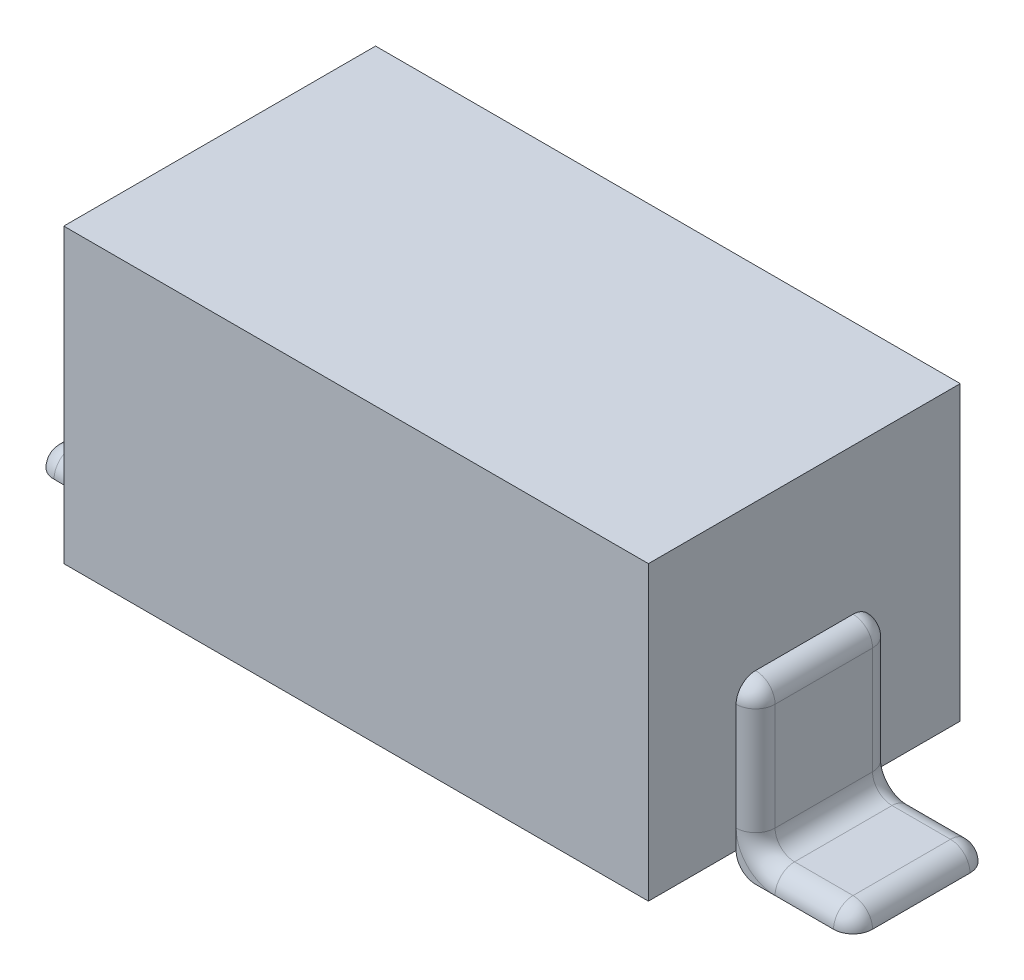
ISO-10303-21;
HEADER;
FILE_DESCRIPTION(('STEP AP214'),'2;1');
FILE_NAME('part.step','',(''),(''),'','','');
FILE_SCHEMA(('AUTOMOTIVE_DESIGN { 1 0 10303 214 1 1 1 1 }'));
ENDSEC;
DATA;
#1=APPLICATION_CONTEXT('core data for automotive mechanical design processes');
#2=APPLICATION_PROTOCOL_DEFINITION('international standard','automotive_design',2000,#1);
#3=PRODUCT_CONTEXT('',#1,'mechanical');
#4=PRODUCT('Part','Part','',(#3));
#5=PRODUCT_RELATED_PRODUCT_CATEGORY('part','',(#4));
#6=PRODUCT_DEFINITION_FORMATION('','',#4);
#7=PRODUCT_DEFINITION_CONTEXT('part definition',#1,'design');
#8=PRODUCT_DEFINITION('design','',#6,#7);
#9=PRODUCT_DEFINITION_SHAPE('','',#8);
#10=(LENGTH_UNIT() NAMED_UNIT(*) SI_UNIT(.MILLI.,.METRE.));
#11=(NAMED_UNIT(*) PLANE_ANGLE_UNIT() SI_UNIT($,.RADIAN.));
#12=(NAMED_UNIT(*) SI_UNIT($,.STERADIAN.) SOLID_ANGLE_UNIT());
#13=UNCERTAINTY_MEASURE_WITH_UNIT(LENGTH_MEASURE(1.E-05),#10,'distance_accuracy_value','');
#14=(GEOMETRIC_REPRESENTATION_CONTEXT(3) GLOBAL_UNCERTAINTY_ASSIGNED_CONTEXT((#13)) GLOBAL_UNIT_ASSIGNED_CONTEXT((#10,
#11,#12)) REPRESENTATION_CONTEXT('',''));
#15=CARTESIAN_POINT('',(0.,0.,0.));
#16=DIRECTION('',(0.,0.,1.));
#17=DIRECTION('',(1.,0.,0.));
#18=AXIS2_PLACEMENT_3D('',#15,#16,#17);
#19=CARTESIAN_POINT('',(-1.6,-0.85,0.35));
#20=DIRECTION('',(0.,0.,1.));
#21=DIRECTION('',(1.,0.,0.));
#22=AXIS2_PLACEMENT_3D('',#19,#20,#21);
#23=PLANE('',#22);
#24=DIRECTION('',(1.,0.,0.));
#25=VECTOR('',#24,1.);
#26=CARTESIAN_POINT('',(-1.6,-0.85,0.35));
#27=LINE('',#26,#25);
#28=CARTESIAN_POINT('',(-1.7,-0.85,0.35));
#29=VERTEX_POINT('',#28);
#30=CARTESIAN_POINT('',(-1.6,-0.85,0.35));
#31=VERTEX_POINT('',#30);
#32=EDGE_CURVE('E305',#29,#31,#27,.T.);
#33=ORIENTED_EDGE('',*,*,#32,.T.);
#34=CARTESIAN_POINT('',(-1.6,-0.75,0.35));
#35=DIRECTION('',(0.,0.,1.));
#36=DIRECTION('',(1.,0.,0.));
#37=AXIS2_PLACEMENT_3D('',#34,#35,#36);
#38=CIRCLE('',#37,0.1);
#39=CARTESIAN_POINT('',(-1.5,-0.75,0.35));
#40=VERTEX_POINT('',#39);
#41=EDGE_CURVE('E376',#31,#40,#38,.T.);
#42=ORIENTED_EDGE('',*,*,#41,.T.);
#43=DIRECTION('',(0.,-1.,0.));
#44=VECTOR('',#43,1.);
#45=CARTESIAN_POINT('',(-1.5,-0.85,0.35));
#46=LINE('',#45,#44);
#47=CARTESIAN_POINT('',(-1.5,-0.65,0.35));
#48=VERTEX_POINT('',#47);
#49=EDGE_CURVE('E310',#48,#40,#46,.T.);
#50=ORIENTED_EDGE('',*,*,#49,.F.);
#51=CARTESIAN_POINT('',(-1.7,-0.65,0.35));
#52=DIRECTION('',(0.,0.,1.));
#53=DIRECTION('',(1.,0.,0.));
#54=AXIS2_PLACEMENT_3D('',#51,#52,#53);
#55=CIRCLE('',#54,0.2);
#56=EDGE_CURVE('E378',#29,#48,#55,.T.);
#57=ORIENTED_EDGE('',*,*,#56,.F.);
#58=EDGE_LOOP('',(#33,#42,#50,#57));
#59=FACE_BOUND('',#58,.T.);
#60=ADVANCED_FACE('F36',(#59),#23,.T.);
#61=CARTESIAN_POINT('',(-1.6,-0.85,-0.35));
#62=DIRECTION('',(0.,0.,-1.));
#63=DIRECTION('',(-1.,0.,0.));
#64=AXIS2_PLACEMENT_3D('',#61,#62,#63);
#65=PLANE('',#64);
#66=CARTESIAN_POINT('',(-1.7,-0.65,-0.35));
#67=DIRECTION('',(0.,0.,-1.));
#68=DIRECTION('',(-1.,0.,0.));
#69=AXIS2_PLACEMENT_3D('',#66,#67,#68);
#70=CIRCLE('',#69,0.2);
#71=CARTESIAN_POINT('',(-1.5,-0.65,-0.35));
#72=VERTEX_POINT('',#71);
#73=CARTESIAN_POINT('',(-1.7,-0.85,-0.35));
#74=VERTEX_POINT('',#73);
#75=EDGE_CURVE('E228',#72,#74,#70,.T.);
#76=ORIENTED_EDGE('',*,*,#75,.F.);
#77=DIRECTION('',(0.,1.,0.));
#78=VECTOR('',#77,1.);
#79=CARTESIAN_POINT('',(-1.5,-0.85,-0.35));
#80=LINE('',#79,#78);
#81=CARTESIAN_POINT('',(-1.5,-0.75,-0.35));
#82=VERTEX_POINT('',#81);
#83=EDGE_CURVE('E229',#82,#72,#80,.T.);
#84=ORIENTED_EDGE('',*,*,#83,.F.);
#85=CARTESIAN_POINT('',(-1.6,-0.75,-0.35));
#86=DIRECTION('',(0.,0.,-1.));
#87=DIRECTION('',(-1.,0.,0.));
#88=AXIS2_PLACEMENT_3D('',#85,#86,#87);
#89=CIRCLE('',#88,0.1);
#90=CARTESIAN_POINT('',(-1.6,-0.85,-0.35));
#91=VERTEX_POINT('',#90);
#92=EDGE_CURVE('E219',#82,#91,#89,.T.);
#93=ORIENTED_EDGE('',*,*,#92,.T.);
#94=DIRECTION('',(1.,0.,0.));
#95=VECTOR('',#94,1.);
#96=CARTESIAN_POINT('',(-1.6,-0.85,-0.35));
#97=LINE('',#96,#95);
#98=EDGE_CURVE('E301',#74,#91,#97,.T.);
#99=ORIENTED_EDGE('',*,*,#98,.F.);
#100=EDGE_LOOP('',(#76,#84,#93,#99));
#101=FACE_BOUND('',#100,.T.);
#102=ADVANCED_FACE('F232',(#101),#65,.T.);
#103=CARTESIAN_POINT('',(1.6,-0.85,0.35));
#104=DIRECTION('',(0.,0.,-1.));
#105=DIRECTION('',(-1.,0.,0.));
#106=AXIS2_PLACEMENT_3D('',#103,#104,#105);
#107=PLANE('',#106);
#108=CARTESIAN_POINT('',(1.7,-0.65,0.35));
#109=DIRECTION('',(0.,0.,-1.));
#110=DIRECTION('',(-1.,0.,0.));
#111=AXIS2_PLACEMENT_3D('',#108,#109,#110);
#112=CIRCLE('',#111,0.2);
#113=CARTESIAN_POINT('',(1.5,-0.65,0.35));
#114=VERTEX_POINT('',#113);
#115=CARTESIAN_POINT('',(1.7,-0.85,0.35));
#116=VERTEX_POINT('',#115);
#117=EDGE_CURVE('E448',#114,#116,#112,.F.);
#118=ORIENTED_EDGE('',*,*,#117,.F.);
#119=DIRECTION('',(0.,-1.,0.));
#120=VECTOR('',#119,1.);
#121=CARTESIAN_POINT('',(1.5,-0.85,0.35));
#122=LINE('',#121,#120);
#123=CARTESIAN_POINT('',(1.5,-0.75,0.35));
#124=VERTEX_POINT('',#123);
#125=EDGE_CURVE('E287',#114,#124,#122,.T.);
#126=ORIENTED_EDGE('',*,*,#125,.T.);
#127=CARTESIAN_POINT('',(1.6,-0.75,0.35));
#128=DIRECTION('',(0.,0.,-1.));
#129=DIRECTION('',(-1.,0.,0.));
#130=AXIS2_PLACEMENT_3D('',#127,#128,#129);
#131=CIRCLE('',#130,0.1);
#132=CARTESIAN_POINT('',(1.6,-0.85,0.35));
#133=VERTEX_POINT('',#132);
#134=EDGE_CURVE('E451',#124,#133,#131,.F.);
#135=ORIENTED_EDGE('',*,*,#134,.T.);
#136=DIRECTION('',(-1.,0.,0.));
#137=VECTOR('',#136,1.);
#138=CARTESIAN_POINT('',(1.6,-0.85,0.35));
#139=LINE('',#138,#137);
#140=EDGE_CURVE('E278',#116,#133,#139,.T.);
#141=ORIENTED_EDGE('',*,*,#140,.F.);
#142=EDGE_LOOP('',(#118,#126,#135,#141));
#143=FACE_BOUND('',#142,.T.);
#144=ADVANCED_FACE('F503',(#143),#107,.F.);
#145=CARTESIAN_POINT('',(1.6,-0.85,-0.35));
#146=DIRECTION('',(0.,0.,1.));
#147=DIRECTION('',(1.,0.,0.));
#148=AXIS2_PLACEMENT_3D('',#145,#146,#147);
#149=PLANE('',#148);
#150=DIRECTION('',(-1.,0.,0.));
#151=VECTOR('',#150,1.);
#152=CARTESIAN_POINT('',(1.6,-0.85,-0.35));
#153=LINE('',#152,#151);
#154=CARTESIAN_POINT('',(1.7,-0.85,-0.35));
#155=VERTEX_POINT('',#154);
#156=CARTESIAN_POINT('',(1.6,-0.85,-0.35));
#157=VERTEX_POINT('',#156);
#158=EDGE_CURVE('E283',#155,#157,#153,.T.);
#159=ORIENTED_EDGE('',*,*,#158,.T.);
#160=CARTESIAN_POINT('',(1.6,-0.75,-0.35));
#161=DIRECTION('',(0.,0.,1.));
#162=DIRECTION('',(1.,0.,0.));
#163=AXIS2_PLACEMENT_3D('',#160,#161,#162);
#164=CIRCLE('',#163,0.1);
#165=CARTESIAN_POINT('',(1.5,-0.75,-0.35));
#166=VERTEX_POINT('',#165);
#167=EDGE_CURVE('E453',#157,#166,#164,.F.);
#168=ORIENTED_EDGE('',*,*,#167,.T.);
#169=DIRECTION('',(0.,1.,0.));
#170=VECTOR('',#169,1.);
#171=CARTESIAN_POINT('',(1.5,-0.85,-0.35));
#172=LINE('',#171,#170);
#173=CARTESIAN_POINT('',(1.5,-0.65,-0.35));
#174=VERTEX_POINT('',#173);
#175=EDGE_CURVE('E296',#166,#174,#172,.T.);
#176=ORIENTED_EDGE('',*,*,#175,.T.);
#177=CARTESIAN_POINT('',(1.7,-0.65,-0.35));
#178=DIRECTION('',(0.,0.,1.));
#179=DIRECTION('',(1.,0.,0.));
#180=AXIS2_PLACEMENT_3D('',#177,#178,#179);
#181=CIRCLE('',#180,0.2);
#182=EDGE_CURVE('E455',#155,#174,#181,.F.);
#183=ORIENTED_EDGE('',*,*,#182,.F.);
#184=EDGE_LOOP('',(#159,#168,#176,#183));
#185=FACE_BOUND('',#184,.T.);
#186=ADVANCED_FACE('F527',(#185),#149,.F.);
#187=CARTESIAN_POINT('',(1.6,0.,0.));
#188=DIRECTION('',(-1.,0.,0.));
#189=DIRECTION('',(0.,0.,1.));
#190=AXIS2_PLACEMENT_3D('',#187,#188,#189);
#191=PLANE('',#190);
#192=DIRECTION('',(0.,0.,1.));
#193=VECTOR('',#192,1.);
#194=CARTESIAN_POINT('',(1.6,-0.65,-0.35));
#195=LINE('',#194,#193);
#196=CARTESIAN_POINT('',(1.6,-0.65,0.25));
#197=VERTEX_POINT('',#196);
#198=CARTESIAN_POINT('',(1.6,-0.65,-0.25));
#199=VERTEX_POINT('',#198);
#200=EDGE_CURVE('E435',#197,#199,#195,.F.);
#201=ORIENTED_EDGE('',*,*,#200,.T.);
#202=DIRECTION('',(0.,1.,0.));
#203=VECTOR('',#202,1.);
#204=CARTESIAN_POINT('',(1.6,0.,-0.25));
#205=LINE('',#204,#203);
#206=CARTESIAN_POINT('',(1.6,-0.1,-0.25));
#207=VERTEX_POINT('',#206);
#208=EDGE_CURVE('E432',#199,#207,#205,.T.);
#209=ORIENTED_EDGE('',*,*,#208,.T.);
#210=DIRECTION('',(0.,0.,1.));
#211=VECTOR('',#210,1.);
#212=CARTESIAN_POINT('',(1.6,-0.1,0.));
#213=LINE('',#212,#211);
#214=CARTESIAN_POINT('',(1.6,-0.1,0.25));
#215=VERTEX_POINT('',#214);
#216=EDGE_CURVE('E437',#207,#215,#213,.T.);
#217=ORIENTED_EDGE('',*,*,#216,.T.);
#218=DIRECTION('',(0.,-1.,0.));
#219=VECTOR('',#218,1.);
#220=CARTESIAN_POINT('',(1.6,0.,0.25));
#221=LINE('',#220,#219);
#222=EDGE_CURVE('E439',#215,#197,#221,.T.);
#223=ORIENTED_EDGE('',*,*,#222,.T.);
#224=EDGE_LOOP('',(#201,#209,#217,#223));
#225=FACE_BOUND('',#224,.T.);
#226=ADVANCED_FACE('F579',(#225),#191,.F.);
#227=CARTESIAN_POINT('',(1.5,0.75,0.8));
#228=DIRECTION('',(-1.,0.,0.));
#229=DIRECTION('',(0.,0.,1.));
#230=AXIS2_PLACEMENT_3D('',#227,#228,#229);
#231=PLANE('',#230);
#232=ORIENTED_EDGE('',*,*,#175,.F.);
#233=DIRECTION('',(0.,0.,-1.));
#234=VECTOR('',#233,1.);
#235=CARTESIAN_POINT('',(1.5,-0.75,0.8));
#236=LINE('',#235,#234);
#237=CARTESIAN_POINT('',(1.5,-0.75,-0.8));
#238=VERTEX_POINT('',#237);
#239=EDGE_CURVE('E267',#166,#238,#236,.T.);
#240=ORIENTED_EDGE('',*,*,#239,.T.);
#241=DIRECTION('',(0.,-1.,0.));
#242=VECTOR('',#241,1.);
#243=CARTESIAN_POINT('',(1.5,0.75,-0.8));
#244=LINE('',#243,#242);
#245=CARTESIAN_POINT('',(1.5,0.75,-0.8));
#246=VERTEX_POINT('',#245);
#247=EDGE_CURVE('E297',#246,#238,#244,.T.);
#248=ORIENTED_EDGE('',*,*,#247,.F.);
#249=DIRECTION('',(0.,0.,-1.));
#250=VECTOR('',#249,1.);
#251=CARTESIAN_POINT('',(1.5,0.75,0.8));
#252=LINE('',#251,#250);
#253=CARTESIAN_POINT('',(1.5,0.75,0.8));
#254=VERTEX_POINT('',#253);
#255=EDGE_CURVE('E254',#254,#246,#252,.T.);
#256=ORIENTED_EDGE('',*,*,#255,.F.);
#257=DIRECTION('',(0.,-1.,0.));
#258=VECTOR('',#257,1.);
#259=CARTESIAN_POINT('',(1.5,0.75,0.8));
#260=LINE('',#259,#258);
#261=CARTESIAN_POINT('',(1.5,-0.75,0.8));
#262=VERTEX_POINT('',#261);
#263=EDGE_CURVE('E271',#254,#262,#260,.T.);
#264=ORIENTED_EDGE('',*,*,#263,.T.);
#265=EDGE_CURVE('E261',#262,#124,#236,.T.);
#266=ORIENTED_EDGE('',*,*,#265,.T.);
#267=ORIENTED_EDGE('',*,*,#125,.F.);
#268=CARTESIAN_POINT('',(1.5,-0.1,0.35));
#269=VERTEX_POINT('',#268);
#270=EDGE_CURVE('E286',#269,#114,#122,.T.);
#271=ORIENTED_EDGE('',*,*,#270,.F.);
#272=CARTESIAN_POINT('',(1.5,-0.1,0.25));
#273=DIRECTION('',(-1.,0.,0.));
#274=DIRECTION('',(0.,0.,1.));
#275=AXIS2_PLACEMENT_3D('',#272,#273,#274);
#276=CIRCLE('',#275,0.1);
#277=CARTESIAN_POINT('',(1.5,0.,0.25));
#278=VERTEX_POINT('',#277);
#279=EDGE_CURVE('E313',#269,#278,#276,.T.);
#280=ORIENTED_EDGE('',*,*,#279,.T.);
#281=DIRECTION('',(0.,0.,1.));
#282=VECTOR('',#281,1.);
#283=CARTESIAN_POINT('',(1.5,0.,0.35));
#284=LINE('',#283,#282);
#285=CARTESIAN_POINT('',(1.5,0.,-0.25));
#286=VERTEX_POINT('',#285);
#287=EDGE_CURVE('E289',#286,#278,#284,.T.);
#288=ORIENTED_EDGE('',*,*,#287,.F.);
#289=CARTESIAN_POINT('',(1.5,-0.1,-0.25));
#290=DIRECTION('',(-1.,0.,0.));
#291=DIRECTION('',(0.,0.,1.));
#292=AXIS2_PLACEMENT_3D('',#289,#290,#291);
#293=CIRCLE('',#292,0.1);
#294=CARTESIAN_POINT('',(1.5,-0.1,-0.35));
#295=VERTEX_POINT('',#294);
#296=EDGE_CURVE('E430',#286,#295,#293,.T.);
#297=ORIENTED_EDGE('',*,*,#296,.T.);
#298=EDGE_CURVE('E293',#174,#295,#172,.T.);
#299=ORIENTED_EDGE('',*,*,#298,.F.);
#300=EDGE_LOOP('',(#232,#240,#248,#256,#264,#266,#267,#271,#280,#288,#297,#299));
#301=FACE_BOUND('',#300,.T.);
#302=ADVANCED_FACE('F476',(#301),#231,.F.);
#303=CARTESIAN_POINT('',(-1.5,0.75,-0.8));
#304=DIRECTION('',(0.,0.,1.));
#305=DIRECTION('',(1.,0.,0.));
#306=AXIS2_PLACEMENT_3D('',#303,#304,#305);
#307=PLANE('',#306);
#308=DIRECTION('',(-1.,0.,0.));
#309=VECTOR('',#308,1.);
#310=CARTESIAN_POINT('',(-1.5,-0.75,-0.8));
#311=LINE('',#310,#309);
#312=CARTESIAN_POINT('',(-1.5,-0.75,-0.8));
#313=VERTEX_POINT('',#312);
#314=EDGE_CURVE('E257',#238,#313,#311,.T.);
#315=ORIENTED_EDGE('',*,*,#314,.T.);
#316=DIRECTION('',(0.,-1.,0.));
#317=VECTOR('',#316,1.);
#318=CARTESIAN_POINT('',(-1.5,0.75,-0.8));
#319=LINE('',#318,#317);
#320=CARTESIAN_POINT('',(-1.5,0.75,-0.8));
#321=VERTEX_POINT('',#320);
#322=EDGE_CURVE('E252',#321,#313,#319,.T.);
#323=ORIENTED_EDGE('',*,*,#322,.F.);
#324=DIRECTION('',(-1.,0.,0.));
#325=VECTOR('',#324,1.);
#326=CARTESIAN_POINT('',(-1.5,0.75,-0.8));
#327=LINE('',#326,#325);
#328=EDGE_CURVE('E274',#246,#321,#327,.T.);
#329=ORIENTED_EDGE('',*,*,#328,.F.);
#330=ORIENTED_EDGE('',*,*,#247,.T.);
#331=EDGE_LOOP('',(#315,#323,#329,#330));
#332=FACE_BOUND('',#331,.T.);
#333=ADVANCED_FACE('F600',(#332),#307,.F.);
#334=CARTESIAN_POINT('',(-1.5,0.75,0.8));
#335=DIRECTION('',(1.,0.,0.));
#336=DIRECTION('',(0.,0.,-1.));
#337=AXIS2_PLACEMENT_3D('',#334,#335,#336);
#338=PLANE('',#337);
#339=DIRECTION('',(0.,0.,1.));
#340=VECTOR('',#339,1.);
#341=CARTESIAN_POINT('',(-1.5,-0.75,0.8));
#342=LINE('',#341,#340);
#343=EDGE_CURVE('E244',#313,#82,#342,.T.);
#344=ORIENTED_EDGE('',*,*,#343,.T.);
#345=ORIENTED_EDGE('',*,*,#83,.T.);
#346=CARTESIAN_POINT('',(-1.5,-0.1,-0.35));
#347=VERTEX_POINT('',#346);
#348=EDGE_CURVE('E236',#72,#347,#80,.T.);
#349=ORIENTED_EDGE('',*,*,#348,.T.);
#350=CARTESIAN_POINT('',(-1.5,-0.1,-0.25));
#351=DIRECTION('',(1.,0.,0.));
#352=DIRECTION('',(0.,0.,-1.));
#353=AXIS2_PLACEMENT_3D('',#350,#351,#352);
#354=CIRCLE('',#353,0.1);
#355=CARTESIAN_POINT('',(-1.5,0.,-0.25));
#356=VERTEX_POINT('',#355);
#357=EDGE_CURVE('E45',#347,#356,#354,.T.);
#358=ORIENTED_EDGE('',*,*,#357,.T.);
#359=DIRECTION('',(0.,0.,1.));
#360=VECTOR('',#359,1.);
#361=CARTESIAN_POINT('',(-1.5,0.,0.35));
#362=LINE('',#361,#360);
#363=CARTESIAN_POINT('',(-1.5,0.,0.25));
#364=VERTEX_POINT('',#363);
#365=EDGE_CURVE('E52',#356,#364,#362,.T.);
#366=ORIENTED_EDGE('',*,*,#365,.T.);
#367=CARTESIAN_POINT('',(-1.5,-0.1,0.25));
#368=DIRECTION('',(1.,0.,0.));
#369=DIRECTION('',(0.,0.,-1.));
#370=AXIS2_PLACEMENT_3D('',#367,#368,#369);
#371=CIRCLE('',#370,0.1);
#372=CARTESIAN_POINT('',(-1.5,-0.1,0.35));
#373=VERTEX_POINT('',#372);
#374=EDGE_CURVE('E11',#364,#373,#371,.T.);
#375=ORIENTED_EDGE('',*,*,#374,.T.);
#376=EDGE_CURVE('E309',#373,#48,#46,.T.);
#377=ORIENTED_EDGE('',*,*,#376,.T.);
#378=ORIENTED_EDGE('',*,*,#49,.T.);
#379=CARTESIAN_POINT('',(-1.5,-0.75,0.8));
#380=VERTEX_POINT('',#379);
#381=EDGE_CURVE('E246',#40,#380,#342,.T.);
#382=ORIENTED_EDGE('',*,*,#381,.T.);
#383=DIRECTION('',(0.,-1.,0.));
#384=VECTOR('',#383,1.);
#385=CARTESIAN_POINT('',(-1.5,0.75,0.8));
#386=LINE('',#385,#384);
#387=CARTESIAN_POINT('',(-1.5,0.75,0.8));
#388=VERTEX_POINT('',#387);
#389=EDGE_CURVE('E469',#388,#380,#386,.T.);
#390=ORIENTED_EDGE('',*,*,#389,.F.);
#391=DIRECTION('',(0.,0.,1.));
#392=VECTOR('',#391,1.);
#393=CARTESIAN_POINT('',(-1.5,0.75,0.8));
#394=LINE('',#393,#392);
#395=EDGE_CURVE('E272',#321,#388,#394,.T.);
#396=ORIENTED_EDGE('',*,*,#395,.F.);
#397=ORIENTED_EDGE('',*,*,#322,.T.);
#398=EDGE_LOOP('',(#344,#345,#349,#358,#366,#375,#377,#378,#382,#390,#396,#397));
#399=FACE_BOUND('',#398,.T.);
#400=ADVANCED_FACE('F249',(#399),#338,.F.);
#401=CARTESIAN_POINT('',(-1.5,0.75,0.8));
#402=DIRECTION('',(0.,0.,-1.));
#403=DIRECTION('',(-1.,0.,0.));
#404=AXIS2_PLACEMENT_3D('',#401,#402,#403);
#405=PLANE('',#404);
#406=DIRECTION('',(1.,0.,0.));
#407=VECTOR('',#406,1.);
#408=CARTESIAN_POINT('',(-1.5,-0.75,0.8));
#409=LINE('',#408,#407);
#410=EDGE_CURVE('E253',#380,#262,#409,.T.);
#411=ORIENTED_EDGE('',*,*,#410,.T.);
#412=ORIENTED_EDGE('',*,*,#263,.F.);
#413=DIRECTION('',(1.,0.,0.));
#414=VECTOR('',#413,1.);
#415=CARTESIAN_POINT('',(-1.5,0.75,0.8));
#416=LINE('',#415,#414);
#417=EDGE_CURVE('E269',#388,#254,#416,.T.);
#418=ORIENTED_EDGE('',*,*,#417,.F.);
#419=ORIENTED_EDGE('',*,*,#389,.T.);
#420=EDGE_LOOP('',(#411,#412,#418,#419));
#421=FACE_BOUND('',#420,.T.);
#422=ADVANCED_FACE('F592',(#421),#405,.F.);
#423=CARTESIAN_POINT('',(0.,0.75,0.));
#424=DIRECTION('',(0.,-1.,0.));
#425=DIRECTION('',(0.,0.,-1.));
#426=AXIS2_PLACEMENT_3D('',#423,#424,#425);
#427=PLANE('',#426);
#428=ORIENTED_EDGE('',*,*,#255,.T.);
#429=ORIENTED_EDGE('',*,*,#328,.T.);
#430=ORIENTED_EDGE('',*,*,#395,.T.);
#431=ORIENTED_EDGE('',*,*,#417,.T.);
#432=EDGE_LOOP('',(#428,#429,#430,#431));
#433=FACE_BOUND('',#432,.T.);
#434=ADVANCED_FACE('F589',(#433),#427,.F.);
#435=CARTESIAN_POINT('',(0.,-0.75,0.));
#436=DIRECTION('',(0.,-1.,0.));
#437=DIRECTION('',(0.,0.,-1.));
#438=AXIS2_PLACEMENT_3D('',#435,#436,#437);
#439=PLANE('',#438);
#440=ORIENTED_EDGE('',*,*,#265,.F.);
#441=ORIENTED_EDGE('',*,*,#410,.F.);
#442=ORIENTED_EDGE('',*,*,#381,.F.);
#443=EDGE_CURVE('E223',#82,#40,#342,.T.);
#444=ORIENTED_EDGE('',*,*,#443,.F.);
#445=ORIENTED_EDGE('',*,*,#343,.F.);
#446=ORIENTED_EDGE('',*,*,#314,.F.);
#447=ORIENTED_EDGE('',*,*,#239,.F.);
#448=EDGE_CURVE('E265',#124,#166,#236,.T.);
#449=ORIENTED_EDGE('',*,*,#448,.F.);
#450=EDGE_LOOP('',(#440,#441,#442,#444,#445,#446,#447,#449));
#451=FACE_BOUND('',#450,.T.);
#452=ADVANCED_FACE('F242',(#451),#439,.T.);
#453=CARTESIAN_POINT('',(1.6,-0.85,0.35));
#454=DIRECTION('',(0.,1.,0.));
#455=DIRECTION('',(0.,0.,1.));
#456=AXIS2_PLACEMENT_3D('',#453,#454,#455);
#457=PLANE('',#456);
#458=CARTESIAN_POINT('',(2.,-0.85,-0.35));
#459=VERTEX_POINT('',#458);
#460=EDGE_CURVE('E282',#459,#155,#153,.T.);
#461=ORIENTED_EDGE('',*,*,#460,.F.);
#462=CARTESIAN_POINT('',(2.,-0.85,-0.25));
#463=DIRECTION('',(0.,1.,0.));
#464=DIRECTION('',(0.,0.,1.));
#465=AXIS2_PLACEMENT_3D('',#462,#463,#464);
#466=CIRCLE('',#465,0.1);
#467=CARTESIAN_POINT('',(2.1,-0.85,-0.25));
#468=VERTEX_POINT('',#467);
#469=EDGE_CURVE('E441',#459,#468,#466,.F.);
#470=ORIENTED_EDGE('',*,*,#469,.T.);
#471=DIRECTION('',(0.,0.,-1.));
#472=VECTOR('',#471,1.);
#473=CARTESIAN_POINT('',(2.1,-0.85,0.35));
#474=LINE('',#473,#472);
#475=CARTESIAN_POINT('',(2.1,-0.85,0.25));
#476=VERTEX_POINT('',#475);
#477=EDGE_CURVE('E292',#476,#468,#474,.T.);
#478=ORIENTED_EDGE('',*,*,#477,.F.);
#479=CARTESIAN_POINT('',(2.,-0.85,0.25));
#480=DIRECTION('',(0.,1.,0.));
#481=DIRECTION('',(0.,0.,1.));
#482=AXIS2_PLACEMENT_3D('',#479,#480,#481);
#483=CIRCLE('',#482,0.1);
#484=CARTESIAN_POINT('',(2.,-0.85,0.35));
#485=VERTEX_POINT('',#484);
#486=EDGE_CURVE('E443',#476,#485,#483,.F.);
#487=ORIENTED_EDGE('',*,*,#486,.T.);
#488=EDGE_CURVE('E281',#485,#116,#139,.T.);
#489=ORIENTED_EDGE('',*,*,#488,.T.);
#490=ORIENTED_EDGE('',*,*,#140,.T.);
#491=DIRECTION('',(0.,0.,-1.));
#492=VECTOR('',#491,1.);
#493=CARTESIAN_POINT('',(1.6,-0.85,-0.35));
#494=LINE('',#493,#492);
#495=EDGE_CURVE('E445',#133,#157,#494,.T.);
#496=ORIENTED_EDGE('',*,*,#495,.T.);
#497=ORIENTED_EDGE('',*,*,#158,.F.);
#498=EDGE_LOOP('',(#461,#470,#478,#487,#489,#490,#496,#497));
#499=FACE_BOUND('',#498,.T.);
#500=ADVANCED_FACE('F491',(#499),#457,.F.);
#501=CARTESIAN_POINT('',(2.1,-0.75,0.35));
#502=DIRECTION('',(0.,-1.,0.));
#503=DIRECTION('',(0.,0.,-1.));
#504=AXIS2_PLACEMENT_3D('',#501,#502,#503);
#505=PLANE('',#504);
#506=DIRECTION('',(-1.,0.,0.));
#507=VECTOR('',#506,1.);
#508=CARTESIAN_POINT('',(2.1,-0.75,0.25));
#509=LINE('',#508,#507);
#510=CARTESIAN_POINT('',(1.7,-0.75,0.25));
#511=VERTEX_POINT('',#510);
#512=CARTESIAN_POINT('',(2.,-0.75,0.25));
#513=VERTEX_POINT('',#512);
#514=EDGE_CURVE('E463',#511,#513,#509,.F.);
#515=ORIENTED_EDGE('',*,*,#514,.T.);
#516=DIRECTION('',(0.,0.,1.));
#517=VECTOR('',#516,1.);
#518=CARTESIAN_POINT('',(2.,-0.75,0.35));
#519=LINE('',#518,#517);
#520=CARTESIAN_POINT('',(2.,-0.75,-0.25));
#521=VERTEX_POINT('',#520);
#522=EDGE_CURVE('E458',#513,#521,#519,.F.);
#523=ORIENTED_EDGE('',*,*,#522,.T.);
#524=DIRECTION('',(-1.,0.,0.));
#525=VECTOR('',#524,1.);
#526=CARTESIAN_POINT('',(2.1,-0.75,-0.25));
#527=LINE('',#526,#525);
#528=CARTESIAN_POINT('',(1.7,-0.75,-0.25));
#529=VERTEX_POINT('',#528);
#530=EDGE_CURVE('E460',#521,#529,#527,.T.);
#531=ORIENTED_EDGE('',*,*,#530,.T.);
#532=DIRECTION('',(0.,0.,1.));
#533=VECTOR('',#532,1.);
#534=CARTESIAN_POINT('',(1.7,-0.75,0.35));
#535=LINE('',#534,#533);
#536=EDGE_CURVE('E465',#529,#511,#535,.T.);
#537=ORIENTED_EDGE('',*,*,#536,.T.);
#538=EDGE_LOOP('',(#515,#523,#531,#537));
#539=FACE_BOUND('',#538,.T.);
#540=ADVANCED_FACE('F545',(#539),#505,.F.);
#541=CARTESIAN_POINT('',(1.5,-0.1,0.25));
#542=DIRECTION('',(0.,0.,1.));
#543=DIRECTION('',(1.,0.,0.));
#544=AXIS2_PLACEMENT_3D('',#541,#542,#543);
#545=SPHERICAL_SURFACE('',#544,0.1);
#546=CARTESIAN_POINT('',(1.5,-0.1,0.25));
#547=DIRECTION('',(0.,0.,1.));
#548=DIRECTION('',(1.,0.,0.));
#549=AXIS2_PLACEMENT_3D('',#546,#547,#548);
#550=CIRCLE('',#549,0.1);
#551=EDGE_CURVE('E393',#278,#215,#550,.F.);
#552=ORIENTED_EDGE('',*,*,#551,.F.);
#553=ORIENTED_EDGE('',*,*,#279,.F.);
#554=CARTESIAN_POINT('',(1.5,-0.1,0.25));
#555=DIRECTION('',(0.,1.,0.));
#556=DIRECTION('',(-1.,0.,0.));
#557=AXIS2_PLACEMENT_3D('',#554,#555,#556);
#558=CIRCLE('',#557,0.1);
#559=EDGE_CURVE('E300',#215,#269,#558,.F.);
#560=ORIENTED_EDGE('',*,*,#559,.F.);
#561=EDGE_LOOP('',(#552,#553,#560));
#562=FACE_BOUND('',#561,.T.);
#563=ADVANCED_FACE('F512',(#562),#545,.T.);
#564=CARTESIAN_POINT('',(1.6,-0.85,0.25));
#565=DIRECTION('',(-1.,0.,0.));
#566=DIRECTION('',(0.,0.,1.));
#567=AXIS2_PLACEMENT_3D('',#564,#565,#566);
#568=CYLINDRICAL_SURFACE('',#567,0.1);
#569=CARTESIAN_POINT('',(1.7,-0.85,0.25));
#570=DIRECTION('',(-1.,0.,0.));
#571=DIRECTION('',(0.,0.,1.));
#572=AXIS2_PLACEMENT_3D('',#569,#570,#571);
#573=CIRCLE('',#572,0.1);
#574=EDGE_CURVE('E399',#116,#511,#573,.T.);
#575=ORIENTED_EDGE('',*,*,#574,.F.);
#576=ORIENTED_EDGE('',*,*,#488,.F.);
#577=CARTESIAN_POINT('',(2.,-0.85,0.25));
#578=DIRECTION('',(1.,0.,0.));
#579=DIRECTION('',(0.,0.,-1.));
#580=AXIS2_PLACEMENT_3D('',#577,#578,#579);
#581=CIRCLE('',#580,0.1);
#582=EDGE_CURVE('E396',#513,#485,#581,.T.);
#583=ORIENTED_EDGE('',*,*,#582,.F.);
#584=ORIENTED_EDGE('',*,*,#514,.F.);
#585=EDGE_LOOP('',(#575,#576,#583,#584));
#586=FACE_BOUND('',#585,.T.);
#587=ADVANCED_FACE('F497',(#586),#568,.T.);
#588=CARTESIAN_POINT('',(1.5,0.,0.25));
#589=DIRECTION('',(0.,-1.,0.));
#590=DIRECTION('',(0.,0.,-1.));
#591=AXIS2_PLACEMENT_3D('',#588,#589,#590);
#592=CYLINDRICAL_SURFACE('',#591,0.1);
#593=ORIENTED_EDGE('',*,*,#559,.T.);
#594=ORIENTED_EDGE('',*,*,#270,.T.);
#595=CARTESIAN_POINT('',(1.5,-0.65,0.25));
#596=DIRECTION('',(0.,-1.,0.));
#597=DIRECTION('',(0.,0.,-1.));
#598=AXIS2_PLACEMENT_3D('',#595,#596,#597);
#599=CIRCLE('',#598,0.1);
#600=EDGE_CURVE('E402',#197,#114,#599,.T.);
#601=ORIENTED_EDGE('',*,*,#600,.F.);
#602=ORIENTED_EDGE('',*,*,#222,.F.);
#603=EDGE_LOOP('',(#593,#594,#601,#602));
#604=FACE_BOUND('',#603,.T.);
#605=ADVANCED_FACE('F507',(#604),#592,.T.);
#606=CARTESIAN_POINT('',(1.5,-0.1,0.));
#607=DIRECTION('',(0.,0.,1.));
#608=DIRECTION('',(1.,0.,0.));
#609=AXIS2_PLACEMENT_3D('',#606,#607,#608);
#610=CYLINDRICAL_SURFACE('',#609,0.1);
#611=ORIENTED_EDGE('',*,*,#551,.T.);
#612=ORIENTED_EDGE('',*,*,#216,.F.);
#613=CARTESIAN_POINT('',(1.5,-0.1,-0.25));
#614=DIRECTION('',(0.,0.,-1.));
#615=DIRECTION('',(-1.,0.,0.));
#616=AXIS2_PLACEMENT_3D('',#613,#614,#615);
#617=CIRCLE('',#616,0.1);
#618=EDGE_CURVE('E405',#286,#207,#617,.T.);
#619=ORIENTED_EDGE('',*,*,#618,.F.);
#620=ORIENTED_EDGE('',*,*,#287,.T.);
#621=EDGE_LOOP('',(#611,#612,#619,#620));
#622=FACE_BOUND('',#621,.T.);
#623=ADVANCED_FACE('F518',(#622),#610,.T.);
#624=CARTESIAN_POINT('',(2.,-0.85,0.25));
#625=DIRECTION('',(0.,0.,1.));
#626=DIRECTION('',(1.,0.,0.));
#627=AXIS2_PLACEMENT_3D('',#624,#625,#626);
#628=SPHERICAL_SURFACE('',#627,0.1);
#629=ORIENTED_EDGE('',*,*,#582,.T.);
#630=ORIENTED_EDGE('',*,*,#486,.F.);
#631=CARTESIAN_POINT('',(2.,-0.85,0.25));
#632=DIRECTION('',(0.,0.,1.));
#633=DIRECTION('',(1.,0.,0.));
#634=AXIS2_PLACEMENT_3D('',#631,#632,#633);
#635=CIRCLE('',#634,0.1);
#636=EDGE_CURVE('E408',#513,#476,#635,.F.);
#637=ORIENTED_EDGE('',*,*,#636,.F.);
#638=EDGE_LOOP('',(#629,#630,#637));
#639=FACE_BOUND('',#638,.T.);
#640=ADVANCED_FACE('F554',(#639),#628,.T.);
#641=CARTESIAN_POINT('',(1.7,-0.65,0.25));
#642=DIRECTION('',(0.,0.,-1.));
#643=DIRECTION('',(-1.,0.,0.));
#644=AXIS2_PLACEMENT_3D('',#641,#642,#643);
#645=TOROIDAL_SURFACE('',#644,0.2,0.1);
#646=ORIENTED_EDGE('',*,*,#117,.T.);
#647=ORIENTED_EDGE('',*,*,#574,.T.);
#648=CARTESIAN_POINT('',(1.7,-0.65,0.25));
#649=DIRECTION('',(0.,0.,-1.));
#650=DIRECTION('',(-1.,0.,0.));
#651=AXIS2_PLACEMENT_3D('',#648,#649,#650);
#652=CIRCLE('',#651,0.1);
#653=EDGE_CURVE('E411',#197,#511,#652,.F.);
#654=ORIENTED_EDGE('',*,*,#653,.F.);
#655=ORIENTED_EDGE('',*,*,#600,.T.);
#656=EDGE_LOOP('',(#646,#647,#654,#655));
#657=FACE_BOUND('',#656,.T.);
#658=ADVANCED_FACE('F500',(#657),#645,.T.);
#659=CARTESIAN_POINT('',(1.5,-0.1,-0.25));
#660=DIRECTION('',(0.,0.,1.));
#661=DIRECTION('',(1.,0.,0.));
#662=AXIS2_PLACEMENT_3D('',#659,#660,#661);
#663=SPHERICAL_SURFACE('',#662,0.1);
#664=ORIENTED_EDGE('',*,*,#296,.F.);
#665=ORIENTED_EDGE('',*,*,#618,.T.);
#666=CARTESIAN_POINT('',(1.5,-0.1,-0.25));
#667=DIRECTION('',(0.,1.,0.));
#668=DIRECTION('',(0.,0.,1.));
#669=AXIS2_PLACEMENT_3D('',#666,#667,#668);
#670=CIRCLE('',#669,0.1);
#671=EDGE_CURVE('E414',#295,#207,#670,.F.);
#672=ORIENTED_EDGE('',*,*,#671,.F.);
#673=EDGE_LOOP('',(#664,#665,#672));
#674=FACE_BOUND('',#673,.T.);
#675=ADVANCED_FACE('F520',(#674),#663,.T.);
#676=CARTESIAN_POINT('',(2.,-0.85,0.));
#677=DIRECTION('',(0.,0.,1.));
#678=DIRECTION('',(1.,0.,0.));
#679=AXIS2_PLACEMENT_3D('',#676,#677,#678);
#680=CYLINDRICAL_SURFACE('',#679,0.1);
#681=ORIENTED_EDGE('',*,*,#636,.T.);
#682=ORIENTED_EDGE('',*,*,#477,.T.);
#683=CARTESIAN_POINT('',(2.,-0.85,-0.25));
#684=DIRECTION('',(0.,0.,-1.));
#685=DIRECTION('',(-1.,0.,0.));
#686=AXIS2_PLACEMENT_3D('',#683,#684,#685);
#687=CIRCLE('',#686,0.1);
#688=EDGE_CURVE('E416',#521,#468,#687,.T.);
#689=ORIENTED_EDGE('',*,*,#688,.F.);
#690=ORIENTED_EDGE('',*,*,#522,.F.);
#691=EDGE_LOOP('',(#681,#682,#689,#690));
#692=FACE_BOUND('',#691,.T.);
#693=ADVANCED_FACE('F549',(#692),#680,.T.);
#694=CARTESIAN_POINT('',(1.7,-0.65,0.35));
#695=DIRECTION('',(0.,0.,-1.));
#696=DIRECTION('',(-1.,0.,0.));
#697=AXIS2_PLACEMENT_3D('',#694,#695,#696);
#698=CYLINDRICAL_SURFACE('',#697,0.1);
#699=ORIENTED_EDGE('',*,*,#653,.T.);
#700=ORIENTED_EDGE('',*,*,#536,.F.);
#701=CARTESIAN_POINT('',(1.7,-0.65,-0.25));
#702=DIRECTION('',(0.,0.,1.));
#703=DIRECTION('',(1.,0.,0.));
#704=AXIS2_PLACEMENT_3D('',#701,#702,#703);
#705=CIRCLE('',#704,0.1);
#706=EDGE_CURVE('E419',#199,#529,#705,.T.);
#707=ORIENTED_EDGE('',*,*,#706,.F.);
#708=ORIENTED_EDGE('',*,*,#200,.F.);
#709=EDGE_LOOP('',(#699,#700,#707,#708));
#710=FACE_BOUND('',#709,.T.);
#711=ADVANCED_FACE('F543',(#710),#698,.F.);
#712=CARTESIAN_POINT('',(1.5,0.,-0.25));
#713=DIRECTION('',(0.,1.,0.));
#714=DIRECTION('',(0.,0.,1.));
#715=AXIS2_PLACEMENT_3D('',#712,#713,#714);
#716=CYLINDRICAL_SURFACE('',#715,0.1);
#717=ORIENTED_EDGE('',*,*,#671,.T.);
#718=ORIENTED_EDGE('',*,*,#208,.F.);
#719=CARTESIAN_POINT('',(1.5,-0.65,-0.25));
#720=DIRECTION('',(0.,-1.,0.));
#721=DIRECTION('',(0.,0.,-1.));
#722=AXIS2_PLACEMENT_3D('',#719,#720,#721);
#723=CIRCLE('',#722,0.1);
#724=EDGE_CURVE('E422',#174,#199,#723,.T.);
#725=ORIENTED_EDGE('',*,*,#724,.F.);
#726=ORIENTED_EDGE('',*,*,#298,.T.);
#727=EDGE_LOOP('',(#717,#718,#725,#726));
#728=FACE_BOUND('',#727,.T.);
#729=ADVANCED_FACE('F524',(#728),#716,.T.);
#730=CARTESIAN_POINT('',(2.,-0.85,-0.25));
#731=DIRECTION('',(0.,0.,1.));
#732=DIRECTION('',(1.,0.,0.));
#733=AXIS2_PLACEMENT_3D('',#730,#731,#732);
#734=SPHERICAL_SURFACE('',#733,0.1);
#735=ORIENTED_EDGE('',*,*,#688,.T.);
#736=ORIENTED_EDGE('',*,*,#469,.F.);
#737=CARTESIAN_POINT('',(2.,-0.85,-0.25));
#738=DIRECTION('',(1.,0.,0.));
#739=DIRECTION('',(0.,0.,-1.));
#740=AXIS2_PLACEMENT_3D('',#737,#738,#739);
#741=CIRCLE('',#740,0.1);
#742=EDGE_CURVE('E425',#521,#459,#741,.F.);
#743=ORIENTED_EDGE('',*,*,#742,.F.);
#744=EDGE_LOOP('',(#735,#736,#743));
#745=FACE_BOUND('',#744,.T.);
#746=ADVANCED_FACE('F551',(#745),#734,.T.);
#747=CARTESIAN_POINT('',(1.7,-0.65,-0.25));
#748=DIRECTION('',(0.,0.,1.));
#749=DIRECTION('',(1.,0.,0.));
#750=AXIS2_PLACEMENT_3D('',#747,#748,#749);
#751=TOROIDAL_SURFACE('',#750,0.2,0.1);
#752=ORIENTED_EDGE('',*,*,#724,.T.);
#753=ORIENTED_EDGE('',*,*,#706,.T.);
#754=CARTESIAN_POINT('',(1.7,-0.85,-0.25));
#755=DIRECTION('',(-1.,0.,0.));
#756=DIRECTION('',(0.,0.,1.));
#757=AXIS2_PLACEMENT_3D('',#754,#755,#756);
#758=CIRCLE('',#757,0.1);
#759=EDGE_CURVE('E427',#155,#529,#758,.F.);
#760=ORIENTED_EDGE('',*,*,#759,.F.);
#761=ORIENTED_EDGE('',*,*,#182,.T.);
#762=EDGE_LOOP('',(#752,#753,#760,#761));
#763=FACE_BOUND('',#762,.T.);
#764=ADVANCED_FACE('F538',(#763),#751,.T.);
#765=CARTESIAN_POINT('',(2.1,-0.85,-0.25));
#766=DIRECTION('',(-1.,0.,0.));
#767=DIRECTION('',(0.,0.,1.));
#768=AXIS2_PLACEMENT_3D('',#765,#766,#767);
#769=CYLINDRICAL_SURFACE('',#768,0.1);
#770=ORIENTED_EDGE('',*,*,#742,.T.);
#771=ORIENTED_EDGE('',*,*,#460,.T.);
#772=ORIENTED_EDGE('',*,*,#759,.T.);
#773=ORIENTED_EDGE('',*,*,#530,.F.);
#774=EDGE_LOOP('',(#770,#771,#772,#773));
#775=FACE_BOUND('',#774,.T.);
#776=ADVANCED_FACE('F533',(#775),#769,.T.);
#777=CARTESIAN_POINT('',(1.6,-0.75,0.35));
#778=DIRECTION('',(0.,0.,1.));
#779=DIRECTION('',(1.,0.,0.));
#780=AXIS2_PLACEMENT_3D('',#777,#778,#779);
#781=CYLINDRICAL_SURFACE('',#780,0.1);
#782=ORIENTED_EDGE('',*,*,#134,.F.);
#783=ORIENTED_EDGE('',*,*,#448,.T.);
#784=ORIENTED_EDGE('',*,*,#167,.F.);
#785=ORIENTED_EDGE('',*,*,#495,.F.);
#786=EDGE_LOOP('',(#782,#783,#784,#785));
#787=FACE_BOUND('',#786,.T.);
#788=ADVANCED_FACE('F529',(#787),#781,.T.);
#789=CARTESIAN_POINT('',(-1.6,-0.85,0.35));
#790=DIRECTION('',(0.,-1.,0.));
#791=DIRECTION('',(0.,0.,-1.));
#792=AXIS2_PLACEMENT_3D('',#789,#790,#791);
#793=PLANE('',#792);
#794=DIRECTION('',(0.,0.,-1.));
#795=VECTOR('',#794,1.);
#796=CARTESIAN_POINT('',(-2.1,-0.85,0.35));
#797=LINE('',#796,#795);
#798=CARTESIAN_POINT('',(-2.1,-0.85,0.25));
#799=VERTEX_POINT('',#798);
#800=CARTESIAN_POINT('',(-2.1,-0.85,-0.25));
#801=VERTEX_POINT('',#800);
#802=EDGE_CURVE('E311',#799,#801,#797,.T.);
#803=ORIENTED_EDGE('',*,*,#802,.T.);
#804=CARTESIAN_POINT('',(-2.,-0.85,-0.25));
#805=DIRECTION('',(0.,-1.,0.));
#806=DIRECTION('',(0.,0.,-1.));
#807=AXIS2_PLACEMENT_3D('',#804,#805,#806);
#808=CIRCLE('',#807,0.1);
#809=CARTESIAN_POINT('',(-2.,-0.85,-0.35));
#810=VERTEX_POINT('',#809);
#811=EDGE_CURVE('E371',#801,#810,#808,.T.);
#812=ORIENTED_EDGE('',*,*,#811,.T.);
#813=EDGE_CURVE('E303',#810,#74,#97,.T.);
#814=ORIENTED_EDGE('',*,*,#813,.T.);
#815=ORIENTED_EDGE('',*,*,#98,.T.);
#816=DIRECTION('',(0.,0.,-1.));
#817=VECTOR('',#816,1.);
#818=CARTESIAN_POINT('',(-1.6,-0.85,0.35));
#819=LINE('',#818,#817);
#820=EDGE_CURVE('E224',#91,#31,#819,.F.);
#821=ORIENTED_EDGE('',*,*,#820,.T.);
#822=ORIENTED_EDGE('',*,*,#32,.F.);
#823=CARTESIAN_POINT('',(-2.,-0.85,0.35));
#824=VERTEX_POINT('',#823);
#825=EDGE_CURVE('E304',#824,#29,#27,.T.);
#826=ORIENTED_EDGE('',*,*,#825,.F.);
#827=CARTESIAN_POINT('',(-2.,-0.85,0.25));
#828=DIRECTION('',(0.,-1.,0.));
#829=DIRECTION('',(0.,0.,-1.));
#830=AXIS2_PLACEMENT_3D('',#827,#828,#829);
#831=CIRCLE('',#830,0.1);
#832=EDGE_CURVE('E373',#824,#799,#831,.T.);
#833=ORIENTED_EDGE('',*,*,#832,.T.);
#834=EDGE_LOOP('',(#803,#812,#814,#815,#821,#822,#826,#833));
#835=FACE_BOUND('',#834,.T.);
#836=ADVANCED_FACE('F574',(#835),#793,.T.);
#837=CARTESIAN_POINT('',(-1.6,0.,0.));
#838=DIRECTION('',(1.,0.,0.));
#839=DIRECTION('',(0.,0.,1.));
#840=AXIS2_PLACEMENT_3D('',#837,#838,#839);
#841=PLANE('',#840);
#842=DIRECTION('',(0.,0.,1.));
#843=VECTOR('',#842,1.);
#844=CARTESIAN_POINT('',(-1.6,-0.1,-0.35));
#845=LINE('',#844,#843);
#846=CARTESIAN_POINT('',(-1.6,-0.1,0.25));
#847=VERTEX_POINT('',#846);
#848=CARTESIAN_POINT('',(-1.6,-0.1,-0.25));
#849=VERTEX_POINT('',#848);
#850=EDGE_CURVE('E367',#847,#849,#845,.F.);
#851=ORIENTED_EDGE('',*,*,#850,.T.);
#852=DIRECTION('',(0.,1.,0.));
#853=VECTOR('',#852,1.);
#854=CARTESIAN_POINT('',(-1.6,-0.75,-0.25));
#855=LINE('',#854,#853);
#856=CARTESIAN_POINT('',(-1.6,-0.65,-0.25));
#857=VERTEX_POINT('',#856);
#858=EDGE_CURVE('E362',#849,#857,#855,.F.);
#859=ORIENTED_EDGE('',*,*,#858,.T.);
#860=DIRECTION('',(0.,0.,1.));
#861=VECTOR('',#860,1.);
#862=CARTESIAN_POINT('',(-1.6,-0.65,0.));
#863=LINE('',#862,#861);
#864=CARTESIAN_POINT('',(-1.6,-0.65,0.25));
#865=VERTEX_POINT('',#864);
#866=EDGE_CURVE('E365',#857,#865,#863,.T.);
#867=ORIENTED_EDGE('',*,*,#866,.T.);
#868=DIRECTION('',(0.,-1.,0.));
#869=VECTOR('',#868,1.);
#870=CARTESIAN_POINT('',(-1.6,0.,0.25));
#871=LINE('',#870,#869);
#872=EDGE_CURVE('E369',#865,#847,#871,.F.);
#873=ORIENTED_EDGE('',*,*,#872,.T.);
#874=EDGE_LOOP('',(#851,#859,#867,#873));
#875=FACE_BOUND('',#874,.T.);
#876=ADVANCED_FACE('F572',(#875),#841,.F.);
#877=CARTESIAN_POINT('',(-2.1,-0.75,0.35));
#878=DIRECTION('',(0.,1.,0.));
#879=DIRECTION('',(0.,0.,1.));
#880=AXIS2_PLACEMENT_3D('',#877,#878,#879);
#881=PLANE('',#880);
#882=DIRECTION('',(1.,0.,0.));
#883=VECTOR('',#882,1.);
#884=CARTESIAN_POINT('',(-2.1,-0.75,-0.25));
#885=LINE('',#884,#883);
#886=CARTESIAN_POINT('',(-1.7,-0.75,-0.25));
#887=VERTEX_POINT('',#886);
#888=CARTESIAN_POINT('',(-2.,-0.75,-0.25));
#889=VERTEX_POINT('',#888);
#890=EDGE_CURVE('E383',#887,#889,#885,.F.);
#891=ORIENTED_EDGE('',*,*,#890,.T.);
#892=DIRECTION('',(0.,0.,1.));
#893=VECTOR('',#892,1.);
#894=CARTESIAN_POINT('',(-2.,-0.75,0.35));
#895=LINE('',#894,#893);
#896=CARTESIAN_POINT('',(-2.,-0.75,0.25));
#897=VERTEX_POINT('',#896);
#898=EDGE_CURVE('E381',#889,#897,#895,.T.);
#899=ORIENTED_EDGE('',*,*,#898,.T.);
#900=DIRECTION('',(1.,0.,0.));
#901=VECTOR('',#900,1.);
#902=CARTESIAN_POINT('',(-2.1,-0.75,0.25));
#903=LINE('',#902,#901);
#904=CARTESIAN_POINT('',(-1.7,-0.75,0.25));
#905=VERTEX_POINT('',#904);
#906=EDGE_CURVE('E386',#897,#905,#903,.T.);
#907=ORIENTED_EDGE('',*,*,#906,.T.);
#908=DIRECTION('',(0.,0.,1.));
#909=VECTOR('',#908,1.);
#910=CARTESIAN_POINT('',(-1.7,-0.75,0.35));
#911=LINE('',#910,#909);
#912=EDGE_CURVE('E388',#905,#887,#911,.F.);
#913=ORIENTED_EDGE('',*,*,#912,.T.);
#914=EDGE_LOOP('',(#891,#899,#907,#913));
#915=FACE_BOUND('',#914,.T.);
#916=ADVANCED_FACE('F664',(#915),#881,.T.);
#917=CARTESIAN_POINT('',(-1.5,-0.1,0.25));
#918=DIRECTION('',(0.,0.,1.));
#919=DIRECTION('',(1.,0.,0.));
#920=AXIS2_PLACEMENT_3D('',#917,#918,#919);
#921=SPHERICAL_SURFACE('',#920,0.1);
#922=CARTESIAN_POINT('',(-1.5,-0.1,0.25));
#923=DIRECTION('',(0.,1.,0.));
#924=DIRECTION('',(0.,0.,1.));
#925=AXIS2_PLACEMENT_3D('',#922,#923,#924);
#926=CIRCLE('',#925,0.1);
#927=EDGE_CURVE('E318',#373,#847,#926,.F.);
#928=ORIENTED_EDGE('',*,*,#927,.F.);
#929=ORIENTED_EDGE('',*,*,#374,.F.);
#930=CARTESIAN_POINT('',(-1.5,-0.1,0.25));
#931=DIRECTION('',(0.,0.,1.));
#932=DIRECTION('',(1.,0.,0.));
#933=AXIS2_PLACEMENT_3D('',#930,#931,#932);
#934=CIRCLE('',#933,0.1);
#935=EDGE_CURVE('E40',#847,#364,#934,.F.);
#936=ORIENTED_EDGE('',*,*,#935,.F.);
#937=EDGE_LOOP('',(#928,#929,#936));
#938=FACE_BOUND('',#937,.T.);
#939=ADVANCED_FACE('F671',(#938),#921,.T.);
#940=CARTESIAN_POINT('',(-1.5,-0.1,0.35));
#941=DIRECTION('',(0.,0.,-1.));
#942=DIRECTION('',(-1.,0.,0.));
#943=AXIS2_PLACEMENT_3D('',#940,#941,#942);
#944=CYLINDRICAL_SURFACE('',#943,0.1);
#945=ORIENTED_EDGE('',*,*,#935,.T.);
#946=ORIENTED_EDGE('',*,*,#365,.F.);
#947=CARTESIAN_POINT('',(-1.5,-0.1,-0.25));
#948=DIRECTION('',(0.,0.,-1.));
#949=DIRECTION('',(-1.,0.,0.));
#950=AXIS2_PLACEMENT_3D('',#947,#948,#949);
#951=CIRCLE('',#950,0.1);
#952=EDGE_CURVE('E329',#849,#356,#951,.T.);
#953=ORIENTED_EDGE('',*,*,#952,.F.);
#954=ORIENTED_EDGE('',*,*,#850,.F.);
#955=EDGE_LOOP('',(#945,#946,#953,#954));
#956=FACE_BOUND('',#955,.T.);
#957=ADVANCED_FACE('F678',(#956),#944,.T.);
#958=CARTESIAN_POINT('',(-1.5,-0.85,0.25));
#959=DIRECTION('',(0.,1.,0.));
#960=DIRECTION('',(0.,0.,1.));
#961=AXIS2_PLACEMENT_3D('',#958,#959,#960);
#962=CYLINDRICAL_SURFACE('',#961,0.1);
#963=ORIENTED_EDGE('',*,*,#927,.T.);
#964=ORIENTED_EDGE('',*,*,#872,.F.);
#965=CARTESIAN_POINT('',(-1.5,-0.65,0.25));
#966=DIRECTION('',(0.,-1.,0.));
#967=DIRECTION('',(0.,0.,-1.));
#968=AXIS2_PLACEMENT_3D('',#965,#966,#967);
#969=CIRCLE('',#968,0.1);
#970=EDGE_CURVE('E334',#48,#865,#969,.T.);
#971=ORIENTED_EDGE('',*,*,#970,.F.);
#972=ORIENTED_EDGE('',*,*,#376,.F.);
#973=EDGE_LOOP('',(#963,#964,#971,#972));
#974=FACE_BOUND('',#973,.T.);
#975=ADVANCED_FACE('F687',(#974),#962,.T.);
#976=CARTESIAN_POINT('',(-2.1,-0.85,0.25));
#977=DIRECTION('',(1.,0.,0.));
#978=DIRECTION('',(0.,0.,-1.));
#979=AXIS2_PLACEMENT_3D('',#976,#977,#978);
#980=CYLINDRICAL_SURFACE('',#979,0.1);
#981=CARTESIAN_POINT('',(-2.,-0.85,0.25));
#982=DIRECTION('',(-1.,0.,0.));
#983=DIRECTION('',(0.,0.,1.));
#984=AXIS2_PLACEMENT_3D('',#981,#982,#983);
#985=CIRCLE('',#984,0.1);
#986=EDGE_CURVE('E323',#824,#897,#985,.T.);
#987=ORIENTED_EDGE('',*,*,#986,.F.);
#988=ORIENTED_EDGE('',*,*,#825,.T.);
#989=CARTESIAN_POINT('',(-1.7,-0.85,0.25));
#990=DIRECTION('',(1.,0.,0.));
#991=DIRECTION('',(0.,0.,-1.));
#992=AXIS2_PLACEMENT_3D('',#989,#990,#991);
#993=CIRCLE('',#992,0.1);
#994=EDGE_CURVE('E337',#905,#29,#993,.T.);
#995=ORIENTED_EDGE('',*,*,#994,.F.);
#996=ORIENTED_EDGE('',*,*,#906,.F.);
#997=EDGE_LOOP('',(#987,#988,#995,#996));
#998=FACE_BOUND('',#997,.T.);
#999=ADVANCED_FACE('F695',(#998),#980,.T.);
#1000=CARTESIAN_POINT('',(-2.,-0.85,0.25));
#1001=DIRECTION('',(0.,0.,1.));
#1002=DIRECTION('',(1.,0.,0.));
#1003=AXIS2_PLACEMENT_3D('',#1000,#1001,#1002);
#1004=SPHERICAL_SURFACE('',#1003,0.1);
#1005=ORIENTED_EDGE('',*,*,#832,.F.);
#1006=ORIENTED_EDGE('',*,*,#986,.T.);
#1007=CARTESIAN_POINT('',(-2.,-0.85,0.25));
#1008=DIRECTION('',(0.,0.,1.));
#1009=DIRECTION('',(1.,0.,0.));
#1010=AXIS2_PLACEMENT_3D('',#1007,#1008,#1009);
#1011=CIRCLE('',#1010,0.1);
#1012=EDGE_CURVE('E340',#799,#897,#1011,.F.);
#1013=ORIENTED_EDGE('',*,*,#1012,.F.);
#1014=EDGE_LOOP('',(#1005,#1006,#1013));
#1015=FACE_BOUND('',#1014,.T.);
#1016=ADVANCED_FACE('F702',(#1015),#1004,.T.);
#1017=CARTESIAN_POINT('',(-1.5,-0.1,-0.25));
#1018=DIRECTION('',(0.,0.,1.));
#1019=DIRECTION('',(1.,0.,0.));
#1020=AXIS2_PLACEMENT_3D('',#1017,#1018,#1019);
#1021=SPHERICAL_SURFACE('',#1020,0.1);
#1022=ORIENTED_EDGE('',*,*,#952,.T.);
#1023=ORIENTED_EDGE('',*,*,#357,.F.);
#1024=CARTESIAN_POINT('',(-1.5,-0.1,-0.25));
#1025=DIRECTION('',(0.,1.,0.));
#1026=DIRECTION('',(-1.,0.,0.));
#1027=AXIS2_PLACEMENT_3D('',#1024,#1025,#1026);
#1028=CIRCLE('',#1027,0.1);
#1029=EDGE_CURVE('E343',#849,#347,#1028,.F.);
#1030=ORIENTED_EDGE('',*,*,#1029,.F.);
#1031=EDGE_LOOP('',(#1022,#1023,#1030));
#1032=FACE_BOUND('',#1031,.T.);
#1033=ADVANCED_FACE('F709',(#1032),#1021,.T.);
#1034=CARTESIAN_POINT('',(-1.7,-0.65,0.25));
#1035=DIRECTION('',(0.,0.,1.));
#1036=DIRECTION('',(1.,0.,0.));
#1037=AXIS2_PLACEMENT_3D('',#1034,#1035,#1036);
#1038=TOROIDAL_SURFACE('',#1037,0.2,0.1);
#1039=ORIENTED_EDGE('',*,*,#56,.T.);
#1040=ORIENTED_EDGE('',*,*,#970,.T.);
#1041=CARTESIAN_POINT('',(-1.7,-0.65,0.25));
#1042=DIRECTION('',(0.,0.,1.));
#1043=DIRECTION('',(1.,0.,0.));
#1044=AXIS2_PLACEMENT_3D('',#1041,#1042,#1043);
#1045=CIRCLE('',#1044,0.1);
#1046=EDGE_CURVE('E346',#905,#865,#1045,.T.);
#1047=ORIENTED_EDGE('',*,*,#1046,.F.);
#1048=ORIENTED_EDGE('',*,*,#994,.T.);
#1049=EDGE_LOOP('',(#1039,#1040,#1047,#1048));
#1050=FACE_BOUND('',#1049,.T.);
#1051=ADVANCED_FACE('F717',(#1050),#1038,.T.);
#1052=CARTESIAN_POINT('',(-2.,-0.85,0.35));
#1053=DIRECTION('',(0.,0.,-1.));
#1054=DIRECTION('',(-1.,0.,0.));
#1055=AXIS2_PLACEMENT_3D('',#1052,#1053,#1054);
#1056=CYLINDRICAL_SURFACE('',#1055,0.1);
#1057=ORIENTED_EDGE('',*,*,#1012,.T.);
#1058=ORIENTED_EDGE('',*,*,#898,.F.);
#1059=CARTESIAN_POINT('',(-2.,-0.85,-0.25));
#1060=DIRECTION('',(0.,0.,-1.));
#1061=DIRECTION('',(-1.,0.,0.));
#1062=AXIS2_PLACEMENT_3D('',#1059,#1060,#1061);
#1063=CIRCLE('',#1062,0.1);
#1064=EDGE_CURVE('E349',#801,#889,#1063,.T.);
#1065=ORIENTED_EDGE('',*,*,#1064,.F.);
#1066=ORIENTED_EDGE('',*,*,#802,.F.);
#1067=EDGE_LOOP('',(#1057,#1058,#1065,#1066));
#1068=FACE_BOUND('',#1067,.T.);
#1069=ADVANCED_FACE('F725',(#1068),#1056,.T.);
#1070=CARTESIAN_POINT('',(-1.5,-0.85,-0.25));
#1071=DIRECTION('',(0.,-1.,0.));
#1072=DIRECTION('',(0.,0.,-1.));
#1073=AXIS2_PLACEMENT_3D('',#1070,#1071,#1072);
#1074=CYLINDRICAL_SURFACE('',#1073,0.1);
#1075=ORIENTED_EDGE('',*,*,#1029,.T.);
#1076=ORIENTED_EDGE('',*,*,#348,.F.);
#1077=CARTESIAN_POINT('',(-1.5,-0.65,-0.25));
#1078=DIRECTION('',(0.,-1.,0.));
#1079=DIRECTION('',(0.,0.,-1.));
#1080=AXIS2_PLACEMENT_3D('',#1077,#1078,#1079);
#1081=CIRCLE('',#1080,0.1);
#1082=EDGE_CURVE('E352',#857,#72,#1081,.T.);
#1083=ORIENTED_EDGE('',*,*,#1082,.F.);
#1084=ORIENTED_EDGE('',*,*,#858,.F.);
#1085=EDGE_LOOP('',(#1075,#1076,#1083,#1084));
#1086=FACE_BOUND('',#1085,.T.);
#1087=ADVANCED_FACE('F733',(#1086),#1074,.T.);
#1088=CARTESIAN_POINT('',(-1.7,-0.65,0.));
#1089=DIRECTION('',(0.,0.,1.));
#1090=DIRECTION('',(1.,0.,0.));
#1091=AXIS2_PLACEMENT_3D('',#1088,#1089,#1090);
#1092=CYLINDRICAL_SURFACE('',#1091,0.1);
#1093=ORIENTED_EDGE('',*,*,#1046,.T.);
#1094=ORIENTED_EDGE('',*,*,#866,.F.);
#1095=CARTESIAN_POINT('',(-1.7,-0.65,-0.25));
#1096=DIRECTION('',(0.,0.,-1.));
#1097=DIRECTION('',(-1.,0.,0.));
#1098=AXIS2_PLACEMENT_3D('',#1095,#1096,#1097);
#1099=CIRCLE('',#1098,0.1);
#1100=EDGE_CURVE('E355',#887,#857,#1099,.F.);
#1101=ORIENTED_EDGE('',*,*,#1100,.F.);
#1102=ORIENTED_EDGE('',*,*,#912,.F.);
#1103=EDGE_LOOP('',(#1093,#1094,#1101,#1102));
#1104=FACE_BOUND('',#1103,.T.);
#1105=ADVANCED_FACE('F741',(#1104),#1092,.F.);
#1106=CARTESIAN_POINT('',(-2.,-0.85,-0.25));
#1107=DIRECTION('',(0.,0.,1.));
#1108=DIRECTION('',(1.,0.,0.));
#1109=AXIS2_PLACEMENT_3D('',#1106,#1107,#1108);
#1110=SPHERICAL_SURFACE('',#1109,0.1);
#1111=ORIENTED_EDGE('',*,*,#811,.F.);
#1112=ORIENTED_EDGE('',*,*,#1064,.T.);
#1113=CARTESIAN_POINT('',(-2.,-0.85,-0.25));
#1114=DIRECTION('',(-1.,0.,0.));
#1115=DIRECTION('',(0.,0.,1.));
#1116=AXIS2_PLACEMENT_3D('',#1113,#1114,#1115);
#1117=CIRCLE('',#1116,0.1);
#1118=EDGE_CURVE('E357',#810,#889,#1117,.F.);
#1119=ORIENTED_EDGE('',*,*,#1118,.F.);
#1120=EDGE_LOOP('',(#1111,#1112,#1119));
#1121=FACE_BOUND('',#1120,.T.);
#1122=ADVANCED_FACE('F748',(#1121),#1110,.T.);
#1123=CARTESIAN_POINT('',(-1.7,-0.65,-0.25));
#1124=DIRECTION('',(0.,0.,-1.));
#1125=DIRECTION('',(-1.,0.,0.));
#1126=AXIS2_PLACEMENT_3D('',#1123,#1124,#1125);
#1127=TOROIDAL_SURFACE('',#1126,0.2,0.1);
#1128=ORIENTED_EDGE('',*,*,#1082,.T.);
#1129=ORIENTED_EDGE('',*,*,#75,.T.);
#1130=CARTESIAN_POINT('',(-1.7,-0.85,-0.25));
#1131=DIRECTION('',(1.,0.,0.));
#1132=DIRECTION('',(0.,0.,-1.));
#1133=AXIS2_PLACEMENT_3D('',#1130,#1131,#1132);
#1134=CIRCLE('',#1133,0.1);
#1135=EDGE_CURVE('E359',#887,#74,#1134,.F.);
#1136=ORIENTED_EDGE('',*,*,#1135,.F.);
#1137=ORIENTED_EDGE('',*,*,#1100,.T.);
#1138=EDGE_LOOP('',(#1128,#1129,#1136,#1137));
#1139=FACE_BOUND('',#1138,.T.);
#1140=ADVANCED_FACE('F755',(#1139),#1127,.T.);
#1141=CARTESIAN_POINT('',(-1.6,-0.85,-0.25));
#1142=DIRECTION('',(1.,0.,0.));
#1143=DIRECTION('',(0.,0.,-1.));
#1144=AXIS2_PLACEMENT_3D('',#1141,#1142,#1143);
#1145=CYLINDRICAL_SURFACE('',#1144,0.1);
#1146=ORIENTED_EDGE('',*,*,#1118,.T.);
#1147=ORIENTED_EDGE('',*,*,#890,.F.);
#1148=ORIENTED_EDGE('',*,*,#1135,.T.);
#1149=ORIENTED_EDGE('',*,*,#813,.F.);
#1150=EDGE_LOOP('',(#1146,#1147,#1148,#1149));
#1151=FACE_BOUND('',#1150,.T.);
#1152=ADVANCED_FACE('F763',(#1151),#1145,.T.);
#1153=CARTESIAN_POINT('',(-1.6,-0.75,0.));
#1154=DIRECTION('',(0.,0.,-1.));
#1155=DIRECTION('',(-1.,0.,0.));
#1156=AXIS2_PLACEMENT_3D('',#1153,#1154,#1155);
#1157=CYLINDRICAL_SURFACE('',#1156,0.1);
#1158=ORIENTED_EDGE('',*,*,#41,.F.);
#1159=ORIENTED_EDGE('',*,*,#820,.F.);
#1160=ORIENTED_EDGE('',*,*,#92,.F.);
#1161=ORIENTED_EDGE('',*,*,#443,.T.);
#1162=EDGE_LOOP('',(#1158,#1159,#1160,#1161));
#1163=FACE_BOUND('',#1162,.T.);
#1164=ADVANCED_FACE('F38',(#1163),#1157,.T.);
#1165=CLOSED_SHELL('',(#60,#102,#144,#186,#226,#302,#333,#400,#422,#434,#452,#500,#540,#563,
#587,#605,#623,#640,#658,#675,#693,#711,#729,#746,#764,#776,#788,#836,#876,#916,#939,#957,#975,
#999,#1016,#1033,#1051,#1069,#1087,#1105,#1122,#1140,#1152,#1164));
#1166=MANIFOLD_SOLID_BREP('B2',#1165);
#1167=ADVANCED_BREP_SHAPE_REPRESENTATION('',(#18,#1166),#14);
#1168=SHAPE_DEFINITION_REPRESENTATION(#9,#1167);
ENDSEC;
END-ISO-10303-21;
